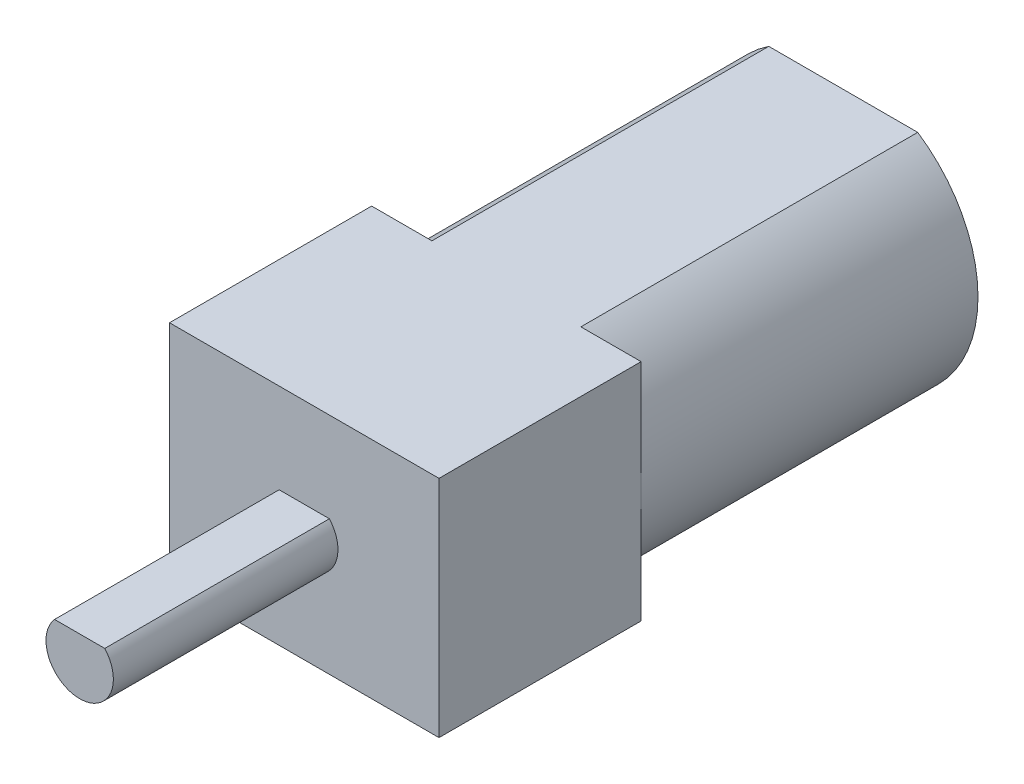
ISO-10303-21;
HEADER;
FILE_DESCRIPTION(('STEP AP214'),'2;1');
FILE_NAME('part.step','',(''),(''),'','','');
FILE_SCHEMA(('AUTOMOTIVE_DESIGN { 1 0 10303 214 1 1 1 1 }'));
ENDSEC;
DATA;
#1=APPLICATION_CONTEXT('core data for automotive mechanical design processes');
#2=APPLICATION_PROTOCOL_DEFINITION('international standard','automotive_design',2000,#1);
#3=PRODUCT_CONTEXT('',#1,'mechanical');
#4=PRODUCT('Part','Part','',(#3));
#5=PRODUCT_RELATED_PRODUCT_CATEGORY('part','',(#4));
#6=PRODUCT_DEFINITION_FORMATION('','',#4);
#7=PRODUCT_DEFINITION_CONTEXT('part definition',#1,'design');
#8=PRODUCT_DEFINITION('design','',#6,#7);
#9=PRODUCT_DEFINITION_SHAPE('','',#8);
#10=(LENGTH_UNIT() NAMED_UNIT(*) SI_UNIT(.MILLI.,.METRE.));
#11=(NAMED_UNIT(*) PLANE_ANGLE_UNIT() SI_UNIT($,.RADIAN.));
#12=(NAMED_UNIT(*) SI_UNIT($,.STERADIAN.) SOLID_ANGLE_UNIT());
#13=UNCERTAINTY_MEASURE_WITH_UNIT(LENGTH_MEASURE(1.E-05),#10,'distance_accuracy_value','');
#14=(GEOMETRIC_REPRESENTATION_CONTEXT(3) GLOBAL_UNCERTAINTY_ASSIGNED_CONTEXT((#13)) GLOBAL_UNIT_ASSIGNED_CONTEXT((#10,
#11,#12)) REPRESENTATION_CONTEXT('',''));
#15=CARTESIAN_POINT('',(0.,0.,0.));
#16=DIRECTION('',(0.,0.,1.));
#17=DIRECTION('',(1.,0.,0.));
#18=AXIS2_PLACEMENT_3D('',#15,#16,#17);
#19=CARTESIAN_POINT('',(0.,0.,15.));
#20=DIRECTION('',(0.,0.,-1.));
#21=DIRECTION('',(-1.,0.,0.));
#22=AXIS2_PLACEMENT_3D('',#19,#20,#21);
#23=CYLINDRICAL_SURFACE('',#22,6.);
#24=CARTESIAN_POINT('',(0.,0.,0.));
#25=DIRECTION('',(0.,0.,1.));
#26=DIRECTION('',(1.,0.,0.));
#27=AXIS2_PLACEMENT_3D('',#24,#25,#26);
#28=CIRCLE('',#27,6.);
#29=CARTESIAN_POINT('',(-3.3166247903554,5.,0.));
#30=VERTEX_POINT('',#29);
#31=CARTESIAN_POINT('',(-3.3166247903554,-5.,0.));
#32=VERTEX_POINT('',#31);
#33=EDGE_CURVE('E185',#30,#32,#28,.T.);
#34=ORIENTED_EDGE('',*,*,#33,.T.);
#35=DIRECTION('',(0.,0.,-1.));
#36=VECTOR('',#35,1.);
#37=CARTESIAN_POINT('',(-3.3166247903554,-5.,15.));
#38=LINE('',#37,#36);
#39=CARTESIAN_POINT('',(-3.3166247903554,-5.,15.));
#40=VERTEX_POINT('',#39);
#41=EDGE_CURVE('E44',#40,#32,#38,.T.);
#42=ORIENTED_EDGE('',*,*,#41,.F.);
#43=CARTESIAN_POINT('',(0.,0.,15.));
#44=DIRECTION('',(0.,0.,1.));
#45=DIRECTION('',(1.,0.,0.));
#46=AXIS2_PLACEMENT_3D('',#43,#44,#45);
#47=CIRCLE('',#46,6.);
#48=CARTESIAN_POINT('',(-6.,0.,15.));
#49=VERTEX_POINT('',#48);
#50=EDGE_CURVE('E189',#49,#40,#47,.T.);
#51=ORIENTED_EDGE('',*,*,#50,.F.);
#52=CARTESIAN_POINT('',(-3.3166247903554,5.,15.));
#53=VERTEX_POINT('',#52);
#54=EDGE_CURVE('E186',#53,#49,#47,.T.);
#55=ORIENTED_EDGE('',*,*,#54,.F.);
#56=DIRECTION('',(0.,0.,-1.));
#57=VECTOR('',#56,1.);
#58=CARTESIAN_POINT('',(-3.3166247903554,5.,15.));
#59=LINE('',#58,#57);
#60=EDGE_CURVE('E192',#53,#30,#59,.T.);
#61=ORIENTED_EDGE('',*,*,#60,.T.);
#62=EDGE_LOOP('',(#34,#42,#51,#55,#61));
#63=FACE_BOUND('',#62,.T.);
#64=ADVANCED_FACE('F41',(#63),#23,.T.);
#65=CARTESIAN_POINT('',(-3.3166247903554,-5.,15.));
#66=DIRECTION('',(0.,1.,0.));
#67=DIRECTION('',(0.,0.,1.));
#68=AXIS2_PLACEMENT_3D('',#65,#66,#67);
#69=PLANE('',#68);
#70=DIRECTION('',(1.,0.,0.));
#71=VECTOR('',#70,1.);
#72=CARTESIAN_POINT('',(-3.3166247903554,-5.,0.));
#73=LINE('',#72,#71);
#74=CARTESIAN_POINT('',(3.31662479035539,-5.,0.));
#75=VERTEX_POINT('',#74);
#76=EDGE_CURVE('E195',#32,#75,#73,.T.);
#77=ORIENTED_EDGE('',*,*,#76,.T.);
#78=DIRECTION('',(0.,0.,-1.));
#79=VECTOR('',#78,1.);
#80=CARTESIAN_POINT('',(3.31662479035539,-5.,15.));
#81=LINE('',#80,#79);
#82=CARTESIAN_POINT('',(3.31662479035539,-5.,15.));
#83=VERTEX_POINT('',#82);
#84=EDGE_CURVE('E205',#83,#75,#81,.T.);
#85=ORIENTED_EDGE('',*,*,#84,.F.);
#86=DIRECTION('',(1.,0.,0.));
#87=VECTOR('',#86,1.);
#88=CARTESIAN_POINT('',(6.,-5.,15.));
#89=LINE('',#88,#87);
#90=CARTESIAN_POINT('',(6.,-5.,15.));
#91=VERTEX_POINT('',#90);
#92=EDGE_CURVE('E163',#83,#91,#89,.T.);
#93=ORIENTED_EDGE('',*,*,#92,.T.);
#94=DIRECTION('',(0.,0.,-1.));
#95=VECTOR('',#94,1.);
#96=CARTESIAN_POINT('',(6.,-5.,24.));
#97=LINE('',#96,#95);
#98=CARTESIAN_POINT('',(6.,-5.,24.));
#99=VERTEX_POINT('',#98);
#100=EDGE_CURVE('E179',#99,#91,#97,.T.);
#101=ORIENTED_EDGE('',*,*,#100,.F.);
#102=DIRECTION('',(1.,0.,0.));
#103=VECTOR('',#102,1.);
#104=CARTESIAN_POINT('',(6.,-5.,24.));
#105=LINE('',#104,#103);
#106=CARTESIAN_POINT('',(-6.,-5.,24.));
#107=VERTEX_POINT('',#106);
#108=EDGE_CURVE('E152',#107,#99,#105,.T.);
#109=ORIENTED_EDGE('',*,*,#108,.F.);
#110=DIRECTION('',(0.,0.,-1.));
#111=VECTOR('',#110,1.);
#112=CARTESIAN_POINT('',(-6.,-5.,24.));
#113=LINE('',#112,#111);
#114=CARTESIAN_POINT('',(-6.,-5.,15.));
#115=VERTEX_POINT('',#114);
#116=EDGE_CURVE('E182',#107,#115,#113,.T.);
#117=ORIENTED_EDGE('',*,*,#116,.T.);
#118=EDGE_CURVE('E164',#115,#40,#89,.T.);
#119=ORIENTED_EDGE('',*,*,#118,.T.);
#120=ORIENTED_EDGE('',*,*,#41,.T.);
#121=EDGE_LOOP('',(#77,#85,#93,#101,#109,#117,#119,#120));
#122=FACE_BOUND('',#121,.T.);
#123=ADVANCED_FACE('F210',(#122),#69,.F.);
#124=CARTESIAN_POINT('',(0.,0.,15.));
#125=DIRECTION('',(0.,0.,-1.));
#126=DIRECTION('',(-1.,0.,0.));
#127=AXIS2_PLACEMENT_3D('',#124,#125,#126);
#128=CYLINDRICAL_SURFACE('',#127,6.);
#129=CARTESIAN_POINT('',(0.,0.,0.));
#130=DIRECTION('',(0.,0.,1.));
#131=DIRECTION('',(1.,0.,0.));
#132=AXIS2_PLACEMENT_3D('',#129,#130,#131);
#133=CIRCLE('',#132,6.);
#134=CARTESIAN_POINT('',(3.3166247903554,5.,0.));
#135=VERTEX_POINT('',#134);
#136=EDGE_CURVE('E197',#75,#135,#133,.T.);
#137=ORIENTED_EDGE('',*,*,#136,.T.);
#138=DIRECTION('',(0.,0.,-1.));
#139=VECTOR('',#138,1.);
#140=CARTESIAN_POINT('',(3.3166247903554,5.,15.));
#141=LINE('',#140,#139);
#142=CARTESIAN_POINT('',(3.3166247903554,5.,15.));
#143=VERTEX_POINT('',#142);
#144=EDGE_CURVE('E203',#143,#135,#141,.T.);
#145=ORIENTED_EDGE('',*,*,#144,.F.);
#146=CARTESIAN_POINT('',(0.,0.,15.));
#147=DIRECTION('',(0.,0.,1.));
#148=DIRECTION('',(1.,0.,0.));
#149=AXIS2_PLACEMENT_3D('',#146,#147,#148);
#150=CIRCLE('',#149,6.);
#151=CARTESIAN_POINT('',(6.,0.,15.));
#152=VERTEX_POINT('',#151);
#153=EDGE_CURVE('E63',#152,#143,#150,.T.);
#154=ORIENTED_EDGE('',*,*,#153,.F.);
#155=EDGE_CURVE('E190',#83,#152,#150,.T.);
#156=ORIENTED_EDGE('',*,*,#155,.F.);
#157=ORIENTED_EDGE('',*,*,#84,.T.);
#158=EDGE_LOOP('',(#137,#145,#154,#156,#157));
#159=FACE_BOUND('',#158,.T.);
#160=ADVANCED_FACE('F219',(#159),#128,.T.);
#161=CARTESIAN_POINT('',(-3.3166247903554,5.,15.));
#162=DIRECTION('',(0.,-1.,0.));
#163=DIRECTION('',(0.,0.,-1.));
#164=AXIS2_PLACEMENT_3D('',#161,#162,#163);
#165=PLANE('',#164);
#166=DIRECTION('',(-1.,0.,0.));
#167=VECTOR('',#166,1.);
#168=CARTESIAN_POINT('',(-3.3166247903554,5.,0.));
#169=LINE('',#168,#167);
#170=EDGE_CURVE('E199',#135,#30,#169,.T.);
#171=ORIENTED_EDGE('',*,*,#170,.T.);
#172=ORIENTED_EDGE('',*,*,#60,.F.);
#173=DIRECTION('',(-1.,0.,0.));
#174=VECTOR('',#173,1.);
#175=CARTESIAN_POINT('',(6.,5.,15.));
#176=LINE('',#175,#174);
#177=CARTESIAN_POINT('',(-6.,5.,15.));
#178=VERTEX_POINT('',#177);
#179=EDGE_CURVE('E171',#53,#178,#176,.T.);
#180=ORIENTED_EDGE('',*,*,#179,.T.);
#181=DIRECTION('',(0.,0.,-1.));
#182=VECTOR('',#181,1.);
#183=CARTESIAN_POINT('',(-6.,5.,24.));
#184=LINE('',#183,#182);
#185=CARTESIAN_POINT('',(-6.,5.,24.));
#186=VERTEX_POINT('',#185);
#187=EDGE_CURVE('E159',#186,#178,#184,.T.);
#188=ORIENTED_EDGE('',*,*,#187,.F.);
#189=DIRECTION('',(-1.,0.,0.));
#190=VECTOR('',#189,1.);
#191=CARTESIAN_POINT('',(6.,5.,24.));
#192=LINE('',#191,#190);
#193=CARTESIAN_POINT('',(6.,5.,24.));
#194=VERTEX_POINT('',#193);
#195=EDGE_CURVE('E157',#194,#186,#192,.T.);
#196=ORIENTED_EDGE('',*,*,#195,.F.);
#197=DIRECTION('',(0.,0.,-1.));
#198=VECTOR('',#197,1.);
#199=CARTESIAN_POINT('',(6.,5.,24.));
#200=LINE('',#199,#198);
#201=CARTESIAN_POINT('',(6.,5.,15.));
#202=VERTEX_POINT('',#201);
#203=EDGE_CURVE('E176',#194,#202,#200,.T.);
#204=ORIENTED_EDGE('',*,*,#203,.T.);
#205=EDGE_CURVE('E153',#202,#143,#176,.T.);
#206=ORIENTED_EDGE('',*,*,#205,.T.);
#207=ORIENTED_EDGE('',*,*,#144,.T.);
#208=EDGE_LOOP('',(#171,#172,#180,#188,#196,#204,#206,#207));
#209=FACE_BOUND('',#208,.T.);
#210=ADVANCED_FACE('F221',(#209),#165,.F.);
#211=CARTESIAN_POINT('',(0.,0.,0.));
#212=DIRECTION('',(0.,0.,1.));
#213=DIRECTION('',(1.,0.,0.));
#214=AXIS2_PLACEMENT_3D('',#211,#212,#213);
#215=PLANE('',#214);
#216=CARTESIAN_POINT('',(0.,0.,0.));
#217=DIRECTION('',(0.,0.,-1.));
#218=DIRECTION('',(-1.,0.,0.));
#219=AXIS2_PLACEMENT_3D('',#216,#217,#218);
#220=CIRCLE('',#219,2.5);
#221=CARTESIAN_POINT('',(-2.5,0.,0.));
#222=VERTEX_POINT('',#221);
#223=EDGE_CURVE('E11',#222,#222,#220,.T.);
#224=ORIENTED_EDGE('',*,*,#223,.F.);
#225=EDGE_LOOP('',(#224));
#226=FACE_BOUND('',#225,.T.);
#227=ORIENTED_EDGE('',*,*,#33,.F.);
#228=ORIENTED_EDGE('',*,*,#170,.F.);
#229=ORIENTED_EDGE('',*,*,#136,.F.);
#230=ORIENTED_EDGE('',*,*,#76,.F.);
#231=EDGE_LOOP('',(#227,#228,#229,#230));
#232=FACE_BOUND('',#231,.T.);
#233=ADVANCED_FACE('F218',(#226,#232),#215,.F.);
#234=CARTESIAN_POINT('',(0.,0.,15.));
#235=DIRECTION('',(0.,0.,1.));
#236=DIRECTION('',(1.,0.,0.));
#237=AXIS2_PLACEMENT_3D('',#234,#235,#236);
#238=PLANE('',#237);
#239=ORIENTED_EDGE('',*,*,#179,.F.);
#240=ORIENTED_EDGE('',*,*,#54,.T.);
#241=DIRECTION('',(0.,-1.,0.));
#242=VECTOR('',#241,1.);
#243=CARTESIAN_POINT('',(-6.,-5.,15.));
#244=LINE('',#243,#242);
#245=EDGE_CURVE('E160',#178,#49,#244,.T.);
#246=ORIENTED_EDGE('',*,*,#245,.F.);
#247=EDGE_LOOP('',(#239,#240,#246));
#248=FACE_BOUND('',#247,.T.);
#249=ADVANCED_FACE('F249',(#248),#238,.F.);
#250=EDGE_CURVE('E144',#49,#115,#244,.T.);
#251=ORIENTED_EDGE('',*,*,#250,.F.);
#252=ORIENTED_EDGE('',*,*,#50,.T.);
#253=ORIENTED_EDGE('',*,*,#118,.F.);
#254=EDGE_LOOP('',(#251,#252,#253));
#255=FACE_BOUND('',#254,.T.);
#256=ADVANCED_FACE('F246',(#255),#238,.F.);
#257=ORIENTED_EDGE('',*,*,#92,.F.);
#258=ORIENTED_EDGE('',*,*,#155,.T.);
#259=DIRECTION('',(0.,1.,0.));
#260=VECTOR('',#259,1.);
#261=CARTESIAN_POINT('',(6.,-5.,15.));
#262=LINE('',#261,#260);
#263=EDGE_CURVE('E168',#91,#152,#262,.T.);
#264=ORIENTED_EDGE('',*,*,#263,.F.);
#265=EDGE_LOOP('',(#257,#258,#264));
#266=FACE_BOUND('',#265,.T.);
#267=ADVANCED_FACE('F235',(#266),#238,.F.);
#268=EDGE_CURVE('E167',#152,#202,#262,.T.);
#269=ORIENTED_EDGE('',*,*,#268,.F.);
#270=ORIENTED_EDGE('',*,*,#153,.T.);
#271=ORIENTED_EDGE('',*,*,#205,.F.);
#272=EDGE_LOOP('',(#269,#270,#271));
#273=FACE_BOUND('',#272,.T.);
#274=ADVANCED_FACE('F227',(#273),#238,.F.);
#275=CARTESIAN_POINT('',(-6.,-5.,24.));
#276=DIRECTION('',(1.,0.,0.));
#277=DIRECTION('',(0.,0.,-1.));
#278=AXIS2_PLACEMENT_3D('',#275,#276,#277);
#279=PLANE('',#278);
#280=ORIENTED_EDGE('',*,*,#245,.T.);
#281=ORIENTED_EDGE('',*,*,#250,.T.);
#282=ORIENTED_EDGE('',*,*,#116,.F.);
#283=DIRECTION('',(0.,-1.,0.));
#284=VECTOR('',#283,1.);
#285=CARTESIAN_POINT('',(-6.,-5.,24.));
#286=LINE('',#285,#284);
#287=EDGE_CURVE('E149',#186,#107,#286,.T.);
#288=ORIENTED_EDGE('',*,*,#287,.F.);
#289=ORIENTED_EDGE('',*,*,#187,.T.);
#290=EDGE_LOOP('',(#280,#281,#282,#288,#289));
#291=FACE_BOUND('',#290,.T.);
#292=ADVANCED_FACE('F242',(#291),#279,.F.);
#293=CARTESIAN_POINT('',(6.,-5.,24.));
#294=DIRECTION('',(-1.,0.,0.));
#295=DIRECTION('',(0.,0.,1.));
#296=AXIS2_PLACEMENT_3D('',#293,#294,#295);
#297=PLANE('',#296);
#298=ORIENTED_EDGE('',*,*,#263,.T.);
#299=ORIENTED_EDGE('',*,*,#268,.T.);
#300=ORIENTED_EDGE('',*,*,#203,.F.);
#301=DIRECTION('',(0.,1.,0.));
#302=VECTOR('',#301,1.);
#303=CARTESIAN_POINT('',(6.,-5.,24.));
#304=LINE('',#303,#302);
#305=EDGE_CURVE('E155',#99,#194,#304,.T.);
#306=ORIENTED_EDGE('',*,*,#305,.F.);
#307=ORIENTED_EDGE('',*,*,#100,.T.);
#308=EDGE_LOOP('',(#298,#299,#300,#306,#307));
#309=FACE_BOUND('',#308,.T.);
#310=ADVANCED_FACE('F230',(#309),#297,.F.);
#311=CARTESIAN_POINT('',(0.,0.,24.));
#312=DIRECTION('',(0.,0.,1.));
#313=DIRECTION('',(1.,0.,0.));
#314=AXIS2_PLACEMENT_3D('',#311,#312,#313);
#315=PLANE('',#314);
#316=CARTESIAN_POINT('',(0.,0.,24.));
#317=DIRECTION('',(0.,0.,1.));
#318=DIRECTION('',(1.,0.,0.));
#319=AXIS2_PLACEMENT_3D('',#316,#317,#318);
#320=CIRCLE('',#319,1.5);
#321=CARTESIAN_POINT('',(-1.11803398874989,1.,24.));
#322=VERTEX_POINT('',#321);
#323=CARTESIAN_POINT('',(1.11803398874989,1.,24.));
#324=VERTEX_POINT('',#323);
#325=EDGE_CURVE('E140',#322,#324,#320,.T.);
#326=ORIENTED_EDGE('',*,*,#325,.F.);
#327=DIRECTION('',(-1.,0.,0.));
#328=VECTOR('',#327,1.);
#329=CARTESIAN_POINT('',(-1.11803398874989,1.,24.));
#330=LINE('',#329,#328);
#331=EDGE_CURVE('E55',#324,#322,#330,.T.);
#332=ORIENTED_EDGE('',*,*,#331,.F.);
#333=EDGE_LOOP('',(#326,#332));
#334=FACE_BOUND('',#333,.T.);
#335=ORIENTED_EDGE('',*,*,#287,.T.);
#336=ORIENTED_EDGE('',*,*,#108,.T.);
#337=ORIENTED_EDGE('',*,*,#305,.T.);
#338=ORIENTED_EDGE('',*,*,#195,.T.);
#339=EDGE_LOOP('',(#335,#336,#337,#338));
#340=FACE_BOUND('',#339,.T.);
#341=ADVANCED_FACE('F237',(#334,#340),#315,.T.);
#342=CARTESIAN_POINT('',(0.,0.,-2.));
#343=DIRECTION('',(0.,0.,1.));
#344=DIRECTION('',(1.,0.,0.));
#345=AXIS2_PLACEMENT_3D('',#342,#343,#344);
#346=CYLINDRICAL_SURFACE('',#345,2.5);
#347=CARTESIAN_POINT('',(0.,0.,-2.));
#348=DIRECTION('',(0.,0.,-1.));
#349=DIRECTION('',(-1.,0.,0.));
#350=AXIS2_PLACEMENT_3D('',#347,#348,#349);
#351=CIRCLE('',#350,2.5);
#352=CARTESIAN_POINT('',(-2.5,0.,-2.));
#353=VERTEX_POINT('',#352);
#354=EDGE_CURVE('E141',#353,#353,#351,.T.);
#355=ORIENTED_EDGE('',*,*,#354,.F.);
#356=EDGE_LOOP('',(#355));
#357=FACE_BOUND('',#356,.T.);
#358=ORIENTED_EDGE('',*,*,#223,.T.);
#359=EDGE_LOOP('',(#358));
#360=FACE_BOUND('',#359,.T.);
#361=ADVANCED_FACE('F277',(#357,#360),#346,.T.);
#362=CARTESIAN_POINT('',(0.,0.,-2.));
#363=DIRECTION('',(0.,0.,-1.));
#364=DIRECTION('',(-1.,0.,0.));
#365=AXIS2_PLACEMENT_3D('',#362,#363,#364);
#366=PLANE('',#365);
#367=ORIENTED_EDGE('',*,*,#354,.T.);
#368=EDGE_LOOP('',(#367));
#369=FACE_BOUND('',#368,.T.);
#370=ADVANCED_FACE('F281',(#369),#366,.T.);
#371=CARTESIAN_POINT('',(0.,0.,34.));
#372=DIRECTION('',(0.,0.,-1.));
#373=DIRECTION('',(-1.,0.,0.));
#374=AXIS2_PLACEMENT_3D('',#371,#372,#373);
#375=CYLINDRICAL_SURFACE('',#374,1.5);
#376=ORIENTED_EDGE('',*,*,#325,.T.);
#377=DIRECTION('',(0.,0.,-1.));
#378=VECTOR('',#377,1.);
#379=CARTESIAN_POINT('',(1.11803398874989,1.,34.));
#380=LINE('',#379,#378);
#381=CARTESIAN_POINT('',(1.11803398874989,1.,34.));
#382=VERTEX_POINT('',#381);
#383=EDGE_CURVE('E128',#382,#324,#380,.T.);
#384=ORIENTED_EDGE('',*,*,#383,.F.);
#385=CARTESIAN_POINT('',(0.,0.,34.));
#386=DIRECTION('',(0.,0.,1.));
#387=DIRECTION('',(1.,0.,0.));
#388=AXIS2_PLACEMENT_3D('',#385,#386,#387);
#389=CIRCLE('',#388,1.5);
#390=CARTESIAN_POINT('',(-1.11803398874989,1.,34.));
#391=VERTEX_POINT('',#390);
#392=EDGE_CURVE('E134',#391,#382,#389,.T.);
#393=ORIENTED_EDGE('',*,*,#392,.F.);
#394=DIRECTION('',(0.,0.,-1.));
#395=VECTOR('',#394,1.);
#396=CARTESIAN_POINT('',(-1.11803398874989,1.,34.));
#397=LINE('',#396,#395);
#398=EDGE_CURVE('E131',#391,#322,#397,.T.);
#399=ORIENTED_EDGE('',*,*,#398,.T.);
#400=EDGE_LOOP('',(#376,#384,#393,#399));
#401=FACE_BOUND('',#400,.T.);
#402=ADVANCED_FACE('F139',(#401),#375,.T.);
#403=CARTESIAN_POINT('',(-1.11803398874989,1.,34.));
#404=DIRECTION('',(0.,-1.,0.));
#405=DIRECTION('',(0.,0.,-1.));
#406=AXIS2_PLACEMENT_3D('',#403,#404,#405);
#407=PLANE('',#406);
#408=ORIENTED_EDGE('',*,*,#331,.T.);
#409=ORIENTED_EDGE('',*,*,#398,.F.);
#410=DIRECTION('',(-1.,0.,0.));
#411=VECTOR('',#410,1.);
#412=CARTESIAN_POINT('',(-1.11803398874989,1.,34.));
#413=LINE('',#412,#411);
#414=EDGE_CURVE('E124',#382,#391,#413,.T.);
#415=ORIENTED_EDGE('',*,*,#414,.F.);
#416=ORIENTED_EDGE('',*,*,#383,.T.);
#417=EDGE_LOOP('',(#408,#409,#415,#416));
#418=FACE_BOUND('',#417,.T.);
#419=ADVANCED_FACE('F126',(#418),#407,.F.);
#420=CARTESIAN_POINT('',(0.,0.,34.));
#421=DIRECTION('',(0.,0.,1.));
#422=DIRECTION('',(1.,0.,0.));
#423=AXIS2_PLACEMENT_3D('',#420,#421,#422);
#424=PLANE('',#423);
#425=ORIENTED_EDGE('',*,*,#392,.T.);
#426=ORIENTED_EDGE('',*,*,#414,.T.);
#427=EDGE_LOOP('',(#425,#426));
#428=FACE_BOUND('',#427,.T.);
#429=ADVANCED_FACE('F136',(#428),#424,.T.);
#430=CLOSED_SHELL('',(#64,#123,#160,#210,#233,#249,#256,#267,#274,#292,#310,#341,#361,#370,#402,
#419,#429));
#431=MANIFOLD_SOLID_BREP('B2',#430);
#432=ADVANCED_BREP_SHAPE_REPRESENTATION('',(#18,#431),#14);
#433=SHAPE_DEFINITION_REPRESENTATION(#9,#432);
ENDSEC;
END-ISO-10303-21;
